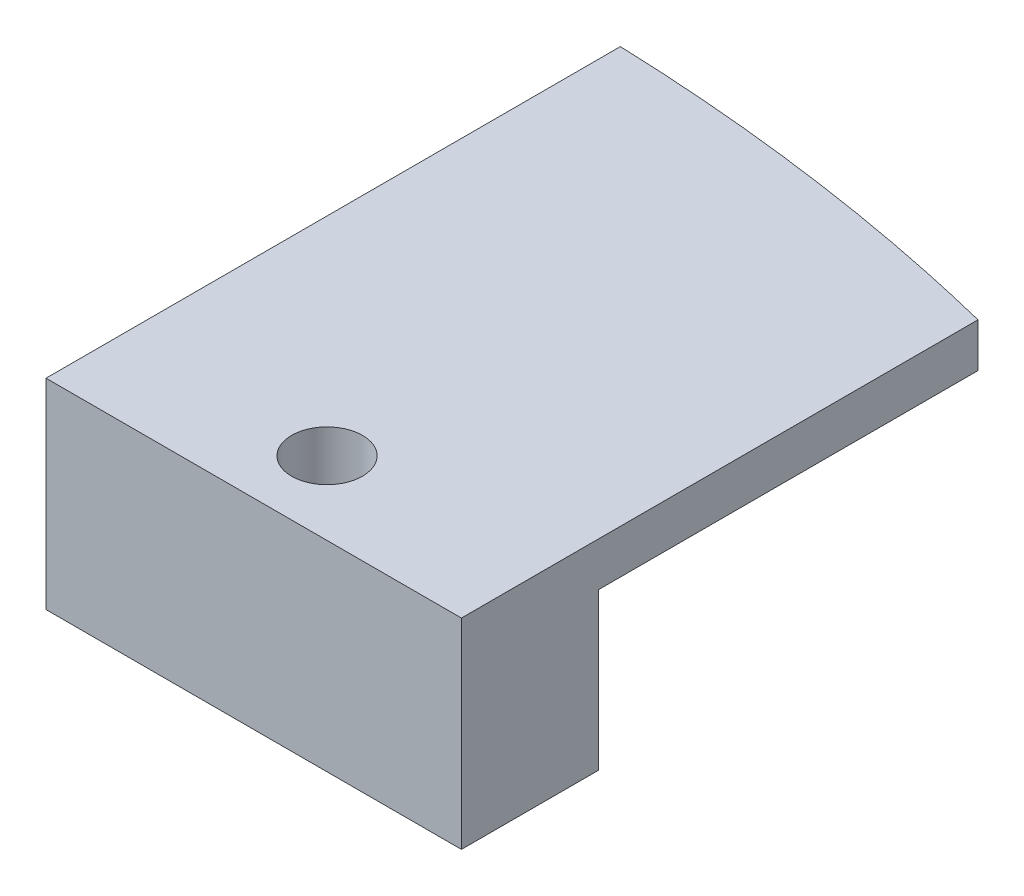
ISO-10303-21;
HEADER;
FILE_DESCRIPTION(('STEP AP214'),'2;1');
FILE_NAME('part.step','',(''),(''),'','','');
FILE_SCHEMA(('AUTOMOTIVE_DESIGN { 1 0 10303 214 1 1 1 1 }'));
ENDSEC;
DATA;
#1=APPLICATION_CONTEXT('core data for automotive mechanical design processes');
#2=APPLICATION_PROTOCOL_DEFINITION('international standard','automotive_design',2000,#1);
#3=PRODUCT_CONTEXT('',#1,'mechanical');
#4=PRODUCT('Part','Part','',(#3));
#5=PRODUCT_RELATED_PRODUCT_CATEGORY('part','',(#4));
#6=PRODUCT_DEFINITION_FORMATION('','',#4);
#7=PRODUCT_DEFINITION_CONTEXT('part definition',#1,'design');
#8=PRODUCT_DEFINITION('design','',#6,#7);
#9=PRODUCT_DEFINITION_SHAPE('','',#8);
#10=(LENGTH_UNIT() NAMED_UNIT(*) SI_UNIT(.MILLI.,.METRE.));
#11=(NAMED_UNIT(*) PLANE_ANGLE_UNIT() SI_UNIT($,.RADIAN.));
#12=(NAMED_UNIT(*) SI_UNIT($,.STERADIAN.) SOLID_ANGLE_UNIT());
#13=UNCERTAINTY_MEASURE_WITH_UNIT(LENGTH_MEASURE(1.E-05),#10,'distance_accuracy_value','');
#14=(GEOMETRIC_REPRESENTATION_CONTEXT(3) GLOBAL_UNCERTAINTY_ASSIGNED_CONTEXT((#13)) GLOBAL_UNIT_ASSIGNED_CONTEXT((#10,
#11,#12)) REPRESENTATION_CONTEXT('',''));
#15=CARTESIAN_POINT('',(0.,0.,0.));
#16=DIRECTION('',(0.,0.,1.));
#17=DIRECTION('',(1.,0.,0.));
#18=AXIS2_PLACEMENT_3D('',#15,#16,#17);
#19=CARTESIAN_POINT('',(0.,0.,0.));
#20=DIRECTION('',(0.,1.,0.));
#21=DIRECTION('',(0.,0.,1.));
#22=AXIS2_PLACEMENT_3D('',#19,#20,#21);
#23=PLANE('',#22);
#24=DIRECTION('',(1.,0.,0.));
#25=VECTOR('',#24,1.);
#26=CARTESIAN_POINT('',(1.86923958314904E-08,0.,12.4));
#27=LINE('',#26,#25);
#28=CARTESIAN_POINT('',(0.,0.,12.4));
#29=VERTEX_POINT('',#28);
#30=CARTESIAN_POINT('',(17.,0.,12.4));
#31=VERTEX_POINT('',#30);
#32=EDGE_CURVE('E57',#29,#31,#27,.T.);
#33=ORIENTED_EDGE('',*,*,#32,.F.);
#34=DIRECTION('',(0.,0.,1.));
#35=VECTOR('',#34,1.);
#36=CARTESIAN_POINT('',(0.,0.,-15.));
#37=LINE('',#36,#35);
#38=CARTESIAN_POINT('',(0.,0.,-5.50440583191058));
#39=VERTEX_POINT('',#38);
#40=EDGE_CURVE('E120',#39,#29,#37,.T.);
#41=ORIENTED_EDGE('',*,*,#40,.F.);
#42=CARTESIAN_POINT('',(-6.64598258480879,0.,59.7672824488272));
#43=DIRECTION('',(0.,-1.,0.));
#44=DIRECTION('',(-0.984807753012208,0.,0.173648177666934));
#45=AXIS2_PLACEMENT_3D('',#42,#43,#44);
#46=ELLIPSE('',#45,75.,65.);
#47=CARTESIAN_POINT('',(17.,0.,-3.13861784911645));
#48=VERTEX_POINT('',#47);
#49=EDGE_CURVE('E136',#48,#39,#46,.F.);
#50=ORIENTED_EDGE('',*,*,#49,.F.);
#51=DIRECTION('',(0.,0.,-1.));
#52=VECTOR('',#51,1.);
#53=CARTESIAN_POINT('',(17.,0.,0.));
#54=LINE('',#53,#52);
#55=EDGE_CURVE('E43',#31,#48,#54,.T.);
#56=ORIENTED_EDGE('',*,*,#55,.F.);
#57=EDGE_LOOP('',(#33,#41,#50,#56));
#58=FACE_BOUND('',#57,.T.);
#59=ADVANCED_FACE('F39',(#58),#23,.F.);
#60=CARTESIAN_POINT('',(0.,1.8,-15.));
#61=DIRECTION('',(1.,0.,0.));
#62=DIRECTION('',(0.,0.,-1.));
#63=AXIS2_PLACEMENT_3D('',#60,#61,#62);
#64=PLANE('',#63);
#65=DIRECTION('',(0.,0.,1.));
#66=VECTOR('',#65,1.);
#67=CARTESIAN_POINT('',(0.,1.8,-15.));
#68=LINE('',#67,#66);
#69=CARTESIAN_POINT('',(0.,1.8,-5.50440583191058));
#70=VERTEX_POINT('',#69);
#71=CARTESIAN_POINT('',(2.45388414449321E-08,1.8,18.));
#72=VERTEX_POINT('',#71);
#73=EDGE_CURVE('E49',#70,#72,#68,.T.);
#74=ORIENTED_EDGE('',*,*,#73,.F.);
#75=DIRECTION('',(0.,1.,0.));
#76=VECTOR('',#75,1.);
#77=CARTESIAN_POINT('',(0.,-0.000999999999999916,-5.50440583191058));
#78=LINE('',#77,#76);
#79=EDGE_CURVE('E186',#39,#70,#78,.T.);
#80=ORIENTED_EDGE('',*,*,#79,.F.);
#81=ORIENTED_EDGE('',*,*,#40,.T.);
#82=DIRECTION('',(0.,1.,0.));
#83=VECTOR('',#82,1.);
#84=CARTESIAN_POINT('',(1.86923958314904E-08,-6.4,12.4));
#85=LINE('',#84,#83);
#86=CARTESIAN_POINT('',(1.86923958314904E-08,-6.4,12.4));
#87=VERTEX_POINT('',#86);
#88=EDGE_CURVE('E100',#87,#29,#85,.T.);
#89=ORIENTED_EDGE('',*,*,#88,.F.);
#90=DIRECTION('',(-1.04400814525745E-09,0.,-1.));
#91=VECTOR('',#90,1.);
#92=CARTESIAN_POINT('',(1.86923958314904E-08,-6.4,12.4));
#93=LINE('',#92,#91);
#94=CARTESIAN_POINT('',(2.45388414449321E-08,-6.4,18.));
#95=VERTEX_POINT('',#94);
#96=EDGE_CURVE('E107',#95,#87,#93,.T.);
#97=ORIENTED_EDGE('',*,*,#96,.F.);
#98=DIRECTION('',(0.,1.,0.));
#99=VECTOR('',#98,1.);
#100=CARTESIAN_POINT('',(2.45388414449321E-08,0.,18.));
#101=LINE('',#100,#99);
#102=EDGE_CURVE('E127',#95,#72,#101,.T.);
#103=ORIENTED_EDGE('',*,*,#102,.T.);
#104=EDGE_LOOP('',(#74,#80,#81,#89,#97,#103));
#105=FACE_BOUND('',#104,.T.);
#106=ADVANCED_FACE('F41',(#105),#64,.F.);
#107=CARTESIAN_POINT('',(17.,1.8,0.));
#108=DIRECTION('',(-1.,0.,0.));
#109=DIRECTION('',(0.,0.,1.));
#110=AXIS2_PLACEMENT_3D('',#107,#108,#109);
#111=PLANE('',#110);
#112=DIRECTION('',(0.,1.,0.));
#113=VECTOR('',#112,1.);
#114=CARTESIAN_POINT('',(17.,0.,18.));
#115=LINE('',#114,#113);
#116=CARTESIAN_POINT('',(17.,-6.4,18.));
#117=VERTEX_POINT('',#116);
#118=CARTESIAN_POINT('',(17.,1.8,18.));
#119=VERTEX_POINT('',#118);
#120=EDGE_CURVE('E132',#117,#119,#115,.T.);
#121=ORIENTED_EDGE('',*,*,#120,.F.);
#122=DIRECTION('',(0.,0.,1.));
#123=VECTOR('',#122,1.);
#124=CARTESIAN_POINT('',(17.,-6.4,18.));
#125=LINE('',#124,#123);
#126=CARTESIAN_POINT('',(17.,-6.4,12.4));
#127=VERTEX_POINT('',#126);
#128=EDGE_CURVE('E106',#127,#117,#125,.T.);
#129=ORIENTED_EDGE('',*,*,#128,.F.);
#130=DIRECTION('',(0.,1.,0.));
#131=VECTOR('',#130,1.);
#132=CARTESIAN_POINT('',(17.,-6.4,12.4));
#133=LINE('',#132,#131);
#134=EDGE_CURVE('E101',#127,#31,#133,.T.);
#135=ORIENTED_EDGE('',*,*,#134,.T.);
#136=ORIENTED_EDGE('',*,*,#55,.T.);
#137=DIRECTION('',(0.,1.,0.));
#138=VECTOR('',#137,1.);
#139=CARTESIAN_POINT('',(17.0000000000001,-0.000999999999999916,-3.13861784911643));
#140=LINE('',#139,#138);
#141=CARTESIAN_POINT('',(17.0000000000001,1.8,-3.13861784911643));
#142=VERTEX_POINT('',#141);
#143=EDGE_CURVE('E192',#48,#142,#140,.T.);
#144=ORIENTED_EDGE('',*,*,#143,.T.);
#145=DIRECTION('',(0.,0.,-1.));
#146=VECTOR('',#145,1.);
#147=CARTESIAN_POINT('',(17.,1.8,0.));
#148=LINE('',#147,#146);
#149=EDGE_CURVE('E11',#119,#142,#148,.T.);
#150=ORIENTED_EDGE('',*,*,#149,.F.);
#151=EDGE_LOOP('',(#121,#129,#135,#136,#144,#150));
#152=FACE_BOUND('',#151,.T.);
#153=ADVANCED_FACE('F156',(#152),#111,.F.);
#154=CARTESIAN_POINT('',(0.,1.8,0.));
#155=DIRECTION('',(0.,1.,0.));
#156=DIRECTION('',(0.,0.,1.));
#157=AXIS2_PLACEMENT_3D('',#154,#155,#156);
#158=PLANE('',#157);
#159=CARTESIAN_POINT('',(8.50000001226942,1.8,15.));
#160=DIRECTION('',(0.,1.,0.));
#161=DIRECTION('',(0.,0.,1.));
#162=AXIS2_PLACEMENT_3D('',#159,#160,#161);
#163=CIRCLE('',#162,1.45);
#164=CARTESIAN_POINT('',(8.50000001226942,1.8,16.45));
#165=VERTEX_POINT('',#164);
#166=EDGE_CURVE('E173',#165,#165,#163,.T.);
#167=ORIENTED_EDGE('',*,*,#166,.F.);
#168=EDGE_LOOP('',(#167));
#169=FACE_BOUND('',#168,.T.);
#170=CARTESIAN_POINT('',(-6.64598258480879,1.8,59.7672824488272));
#171=DIRECTION('',(0.,-1.,0.));
#172=DIRECTION('',(-0.984807753012208,0.,0.173648177666934));
#173=AXIS2_PLACEMENT_3D('',#170,#171,#172);
#174=ELLIPSE('',#173,75.,65.);
#175=EDGE_CURVE('E141',#70,#142,#174,.T.);
#176=ORIENTED_EDGE('',*,*,#175,.F.);
#177=ORIENTED_EDGE('',*,*,#73,.T.);
#178=DIRECTION('',(1.,0.,0.));
#179=VECTOR('',#178,1.);
#180=CARTESIAN_POINT('',(17.,1.8,18.));
#181=LINE('',#180,#179);
#182=EDGE_CURVE('E122',#72,#119,#181,.T.);
#183=ORIENTED_EDGE('',*,*,#182,.T.);
#184=ORIENTED_EDGE('',*,*,#149,.T.);
#185=EDGE_LOOP('',(#176,#177,#183,#184));
#186=FACE_BOUND('',#185,.T.);
#187=ADVANCED_FACE('F151',(#169,#186),#158,.T.);
#188=CARTESIAN_POINT('',(-6.64598258480879,-0.000999999999999916,59.7672824488272));
#189=DIRECTION('',(0.,-1.,0.));
#190=DIRECTION('',(-0.984807753012208,0.,0.173648177666934));
#191=AXIS2_PLACEMENT_3D('',#188,#189,#190);
#192=ELLIPSE('',#191,75.,65.);
#193=DIRECTION('',(0.,1.,0.));
#194=VECTOR('',#193,1.);
#195=SURFACE_OF_LINEAR_EXTRUSION('',#192,#194);
#196=ORIENTED_EDGE('',*,*,#49,.T.);
#197=ORIENTED_EDGE('',*,*,#79,.T.);
#198=ORIENTED_EDGE('',*,*,#175,.T.);
#199=ORIENTED_EDGE('',*,*,#143,.F.);
#200=EDGE_LOOP('',(#196,#197,#198,#199));
#201=FACE_BOUND('',#200,.T.);
#202=ADVANCED_FACE('F146',(#201),#195,.F.);
#203=CARTESIAN_POINT('',(17.,0.,18.));
#204=DIRECTION('',(0.,0.,1.));
#205=DIRECTION('',(1.,0.,0.));
#206=AXIS2_PLACEMENT_3D('',#203,#204,#205);
#207=PLANE('',#206);
#208=ORIENTED_EDGE('',*,*,#182,.F.);
#209=ORIENTED_EDGE('',*,*,#102,.F.);
#210=DIRECTION('',(-1.,0.,0.));
#211=VECTOR('',#210,1.);
#212=CARTESIAN_POINT('',(2.45388414449321E-08,-6.4,18.));
#213=LINE('',#212,#211);
#214=EDGE_CURVE('E113',#117,#95,#213,.T.);
#215=ORIENTED_EDGE('',*,*,#214,.F.);
#216=ORIENTED_EDGE('',*,*,#120,.T.);
#217=EDGE_LOOP('',(#208,#209,#215,#216));
#218=FACE_BOUND('',#217,.T.);
#219=ADVANCED_FACE('F150',(#218),#207,.T.);
#220=CARTESIAN_POINT('',(1.86923958314904E-08,-6.4,12.4));
#221=DIRECTION('',(0.,0.,1.));
#222=DIRECTION('',(1.,0.,0.));
#223=AXIS2_PLACEMENT_3D('',#220,#221,#222);
#224=PLANE('',#223);
#225=ORIENTED_EDGE('',*,*,#32,.T.);
#226=ORIENTED_EDGE('',*,*,#134,.F.);
#227=DIRECTION('',(1.,0.,0.));
#228=VECTOR('',#227,1.);
#229=CARTESIAN_POINT('',(1.86923958314904E-08,-6.4,12.4));
#230=LINE('',#229,#228);
#231=EDGE_CURVE('E96',#87,#127,#230,.T.);
#232=ORIENTED_EDGE('',*,*,#231,.F.);
#233=ORIENTED_EDGE('',*,*,#88,.T.);
#234=EDGE_LOOP('',(#225,#226,#232,#233));
#235=FACE_BOUND('',#234,.T.);
#236=ADVANCED_FACE('F98',(#235),#224,.F.);
#237=CARTESIAN_POINT('',(0.,-6.4,0.));
#238=DIRECTION('',(0.,1.,0.));
#239=DIRECTION('',(0.,0.,1.));
#240=AXIS2_PLACEMENT_3D('',#237,#238,#239);
#241=PLANE('',#240);
#242=CARTESIAN_POINT('',(8.50000001226942,-6.4,15.));
#243=DIRECTION('',(0.,1.,0.));
#244=DIRECTION('',(0.,0.,1.));
#245=AXIS2_PLACEMENT_3D('',#242,#243,#244);
#246=CIRCLE('',#245,1.45);
#247=CARTESIAN_POINT('',(8.50000001226942,-6.4,16.45));
#248=VERTEX_POINT('',#247);
#249=EDGE_CURVE('E170',#248,#248,#246,.F.);
#250=ORIENTED_EDGE('',*,*,#249,.F.);
#251=EDGE_LOOP('',(#250));
#252=FACE_BOUND('',#251,.T.);
#253=ORIENTED_EDGE('',*,*,#96,.T.);
#254=ORIENTED_EDGE('',*,*,#231,.T.);
#255=ORIENTED_EDGE('',*,*,#128,.T.);
#256=ORIENTED_EDGE('',*,*,#214,.T.);
#257=EDGE_LOOP('',(#253,#254,#255,#256));
#258=FACE_BOUND('',#257,.T.);
#259=ADVANCED_FACE('F111',(#252,#258),#241,.F.);
#260=CARTESIAN_POINT('',(8.50000001226942,-6.401,15.));
#261=DIRECTION('',(0.,1.,0.));
#262=DIRECTION('',(0.,0.,1.));
#263=AXIS2_PLACEMENT_3D('',#260,#261,#262);
#264=CYLINDRICAL_SURFACE('',#263,1.45);
#265=ORIENTED_EDGE('',*,*,#166,.T.);
#266=EDGE_LOOP('',(#265));
#267=FACE_BOUND('',#266,.T.);
#268=ORIENTED_EDGE('',*,*,#249,.T.);
#269=EDGE_LOOP('',(#268));
#270=FACE_BOUND('',#269,.T.);
#271=ADVANCED_FACE('F182',(#267,#270),#264,.F.);
#272=CLOSED_SHELL('',(#59,#106,#153,#187,#202,#219,#236,#259,#271));
#273=MANIFOLD_SOLID_BREP('B2',#272);
#274=ADVANCED_BREP_SHAPE_REPRESENTATION('',(#18,#273),#14);
#275=SHAPE_DEFINITION_REPRESENTATION(#9,#274);
ENDSEC;
END-ISO-10303-21;
